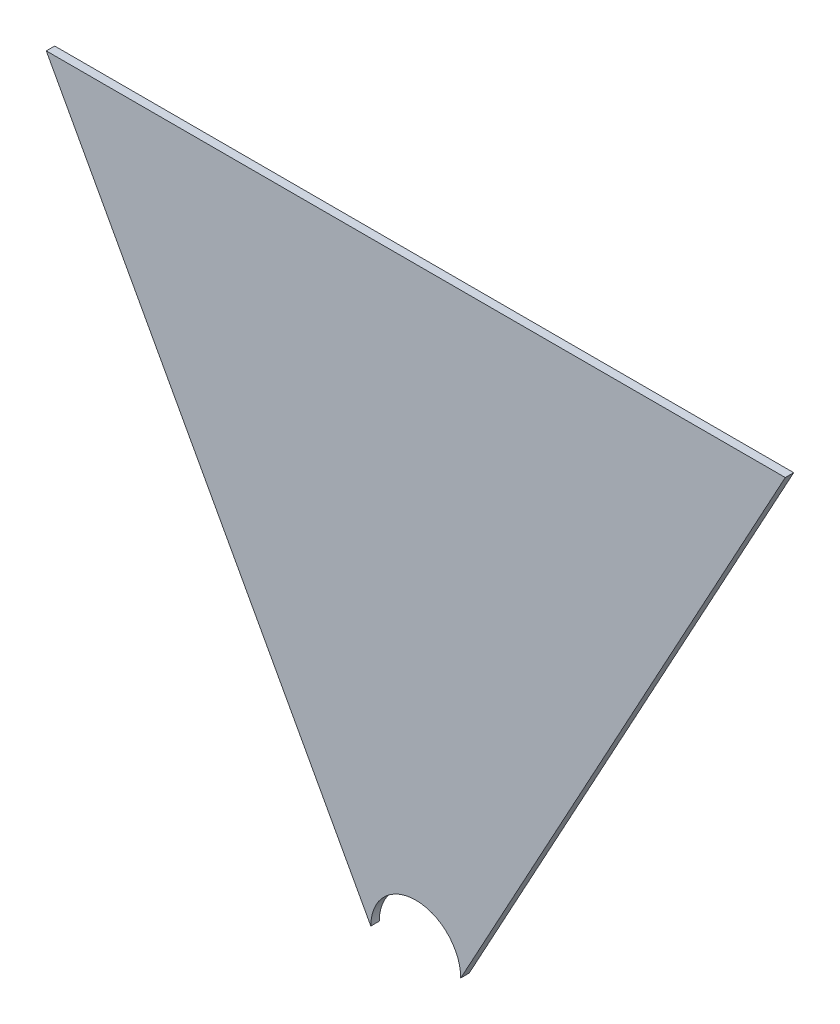
ISO-10303-21;
HEADER;
FILE_DESCRIPTION(('STEP AP214'),'2;1');
FILE_NAME('part.step','',(''),(''),'','','');
FILE_SCHEMA(('AUTOMOTIVE_DESIGN { 1 0 10303 214 1 1 1 1 }'));
ENDSEC;
DATA;
#1=APPLICATION_CONTEXT('core data for automotive mechanical design processes');
#2=APPLICATION_PROTOCOL_DEFINITION('international standard','automotive_design',2000,#1);
#3=PRODUCT_CONTEXT('',#1,'mechanical');
#4=PRODUCT('Part','Part','',(#3));
#5=PRODUCT_RELATED_PRODUCT_CATEGORY('part','',(#4));
#6=PRODUCT_DEFINITION_FORMATION('','',#4);
#7=PRODUCT_DEFINITION_CONTEXT('part definition',#1,'design');
#8=PRODUCT_DEFINITION('design','',#6,#7);
#9=PRODUCT_DEFINITION_SHAPE('','',#8);
#10=(LENGTH_UNIT() NAMED_UNIT(*) SI_UNIT(.MILLI.,.METRE.));
#11=(NAMED_UNIT(*) PLANE_ANGLE_UNIT() SI_UNIT($,.RADIAN.));
#12=(NAMED_UNIT(*) SI_UNIT($,.STERADIAN.) SOLID_ANGLE_UNIT());
#13=UNCERTAINTY_MEASURE_WITH_UNIT(LENGTH_MEASURE(1.E-05),#10,'distance_accuracy_value','');
#14=(GEOMETRIC_REPRESENTATION_CONTEXT(3) GLOBAL_UNCERTAINTY_ASSIGNED_CONTEXT((#13)) GLOBAL_UNIT_ASSIGNED_CONTEXT((#10,
#11,#12)) REPRESENTATION_CONTEXT('',''));
#15=CARTESIAN_POINT('',(0.,0.,0.));
#16=DIRECTION('',(0.,0.,1.));
#17=DIRECTION('',(1.,0.,0.));
#18=AXIS2_PLACEMENT_3D('',#15,#16,#17);
#19=CARTESIAN_POINT('',(-16.,0.,3.));
#20=DIRECTION('',(0.878132912292132,0.478416751744062,0.));
#21=DIRECTION('',(-0.478416751744062,0.878132912292132,0.));
#22=AXIS2_PLACEMENT_3D('',#19,#20,#21);
#23=PLANE('',#22);
#24=DIRECTION('',(0.478416751744062,-0.878132912292131,0.));
#25=VECTOR('',#24,1.);
#26=CARTESIAN_POINT('',(-16.,0.,0.));
#27=LINE('',#26,#25);
#28=CARTESIAN_POINT('',(-131.5,212.,0.));
#29=VERTEX_POINT('',#28);
#30=CARTESIAN_POINT('',(-16.,0.,0.));
#31=VERTEX_POINT('',#30);
#32=EDGE_CURVE('E96',#29,#31,#27,.T.);
#33=ORIENTED_EDGE('',*,*,#32,.T.);
#34=DIRECTION('',(0.,0.,-1.));
#35=VECTOR('',#34,1.);
#36=CARTESIAN_POINT('',(-16.,0.,3.));
#37=LINE('',#36,#35);
#38=CARTESIAN_POINT('',(-16.,0.,3.));
#39=VERTEX_POINT('',#38);
#40=EDGE_CURVE('E11',#39,#31,#37,.T.);
#41=ORIENTED_EDGE('',*,*,#40,.F.);
#42=DIRECTION('',(0.478416751744062,-0.878132912292131,0.));
#43=VECTOR('',#42,1.);
#44=CARTESIAN_POINT('',(-16.,0.,3.));
#45=LINE('',#44,#43);
#46=CARTESIAN_POINT('',(-131.5,212.,3.));
#47=VERTEX_POINT('',#46);
#48=EDGE_CURVE('E84',#47,#39,#45,.T.);
#49=ORIENTED_EDGE('',*,*,#48,.F.);
#50=DIRECTION('',(0.,0.,-1.));
#51=VECTOR('',#50,1.);
#52=CARTESIAN_POINT('',(-131.5,212.,3.));
#53=LINE('',#52,#51);
#54=EDGE_CURVE('E92',#47,#29,#53,.T.);
#55=ORIENTED_EDGE('',*,*,#54,.T.);
#56=EDGE_LOOP('',(#33,#41,#49,#55));
#57=FACE_BOUND('',#56,.T.);
#58=ADVANCED_FACE('F33',(#57),#23,.F.);
#59=CARTESIAN_POINT('',(0.,0.,3.));
#60=DIRECTION('',(0.,0.,-1.));
#61=DIRECTION('',(-1.,0.,0.));
#62=AXIS2_PLACEMENT_3D('',#59,#60,#61);
#63=CYLINDRICAL_SURFACE('',#62,16.);
#64=CARTESIAN_POINT('',(0.,0.,0.));
#65=DIRECTION('',(0.,0.,-1.));
#66=DIRECTION('',(1.,0.,0.));
#67=AXIS2_PLACEMENT_3D('',#64,#65,#66);
#68=CIRCLE('',#67,16.);
#69=CARTESIAN_POINT('',(16.,0.,0.));
#70=VERTEX_POINT('',#69);
#71=EDGE_CURVE('E88',#31,#70,#68,.T.);
#72=ORIENTED_EDGE('',*,*,#71,.T.);
#73=DIRECTION('',(0.,0.,-1.));
#74=VECTOR('',#73,1.);
#75=CARTESIAN_POINT('',(16.,0.,3.));
#76=LINE('',#75,#74);
#77=CARTESIAN_POINT('',(16.,0.,3.));
#78=VERTEX_POINT('',#77);
#79=EDGE_CURVE('E41',#78,#70,#76,.T.);
#80=ORIENTED_EDGE('',*,*,#79,.F.);
#81=CARTESIAN_POINT('',(0.,0.,3.));
#82=DIRECTION('',(0.,0.,-1.));
#83=DIRECTION('',(1.,0.,0.));
#84=AXIS2_PLACEMENT_3D('',#81,#82,#83);
#85=CIRCLE('',#84,16.);
#86=EDGE_CURVE('E79',#39,#78,#85,.T.);
#87=ORIENTED_EDGE('',*,*,#86,.F.);
#88=ORIENTED_EDGE('',*,*,#40,.T.);
#89=EDGE_LOOP('',(#72,#80,#87,#88));
#90=FACE_BOUND('',#89,.T.);
#91=ADVANCED_FACE('F87',(#90),#63,.F.);
#92=CARTESIAN_POINT('',(16.,0.,3.));
#93=DIRECTION('',(-0.878132912292132,0.478416751744062,0.));
#94=DIRECTION('',(-0.478416751744062,-0.878132912292132,0.));
#95=AXIS2_PLACEMENT_3D('',#92,#93,#94);
#96=PLANE('',#95);
#97=DIRECTION('',(0.478416751744062,0.878132912292132,0.));
#98=VECTOR('',#97,1.);
#99=CARTESIAN_POINT('',(16.,0.,0.));
#100=LINE('',#99,#98);
#101=CARTESIAN_POINT('',(131.5,212.,0.));
#102=VERTEX_POINT('',#101);
#103=EDGE_CURVE('E66',#70,#102,#100,.T.);
#104=ORIENTED_EDGE('',*,*,#103,.T.);
#105=DIRECTION('',(0.,0.,-1.));
#106=VECTOR('',#105,1.);
#107=CARTESIAN_POINT('',(131.5,212.,3.));
#108=LINE('',#107,#106);
#109=CARTESIAN_POINT('',(131.5,212.,3.));
#110=VERTEX_POINT('',#109);
#111=EDGE_CURVE('E89',#110,#102,#108,.T.);
#112=ORIENTED_EDGE('',*,*,#111,.F.);
#113=DIRECTION('',(0.478416751744062,0.878132912292132,0.));
#114=VECTOR('',#113,1.);
#115=CARTESIAN_POINT('',(16.,0.,3.));
#116=LINE('',#115,#114);
#117=EDGE_CURVE('E82',#78,#110,#116,.T.);
#118=ORIENTED_EDGE('',*,*,#117,.F.);
#119=ORIENTED_EDGE('',*,*,#79,.T.);
#120=EDGE_LOOP('',(#104,#112,#118,#119));
#121=FACE_BOUND('',#120,.T.);
#122=ADVANCED_FACE('F90',(#121),#96,.F.);
#123=CARTESIAN_POINT('',(-131.5,212.,3.));
#124=DIRECTION('',(0.,-1.,0.));
#125=DIRECTION('',(0.,0.,-1.));
#126=AXIS2_PLACEMENT_3D('',#123,#124,#125);
#127=PLANE('',#126);
#128=DIRECTION('',(-1.,0.,0.));
#129=VECTOR('',#128,1.);
#130=CARTESIAN_POINT('',(-131.5,212.,0.));
#131=LINE('',#130,#129);
#132=EDGE_CURVE('E72',#102,#29,#131,.T.);
#133=ORIENTED_EDGE('',*,*,#132,.T.);
#134=ORIENTED_EDGE('',*,*,#54,.F.);
#135=DIRECTION('',(-1.,0.,0.));
#136=VECTOR('',#135,1.);
#137=CARTESIAN_POINT('',(-131.5,212.,3.));
#138=LINE('',#137,#136);
#139=EDGE_CURVE('E49',#110,#47,#138,.T.);
#140=ORIENTED_EDGE('',*,*,#139,.F.);
#141=ORIENTED_EDGE('',*,*,#111,.T.);
#142=EDGE_LOOP('',(#133,#134,#140,#141));
#143=FACE_BOUND('',#142,.T.);
#144=ADVANCED_FACE('F103',(#143),#127,.F.);
#145=CARTESIAN_POINT('',(0.,0.,3.));
#146=DIRECTION('',(0.,0.,1.));
#147=DIRECTION('',(1.,0.,0.));
#148=AXIS2_PLACEMENT_3D('',#145,#146,#147);
#149=PLANE('',#148);
#150=ORIENTED_EDGE('',*,*,#48,.T.);
#151=ORIENTED_EDGE('',*,*,#86,.T.);
#152=ORIENTED_EDGE('',*,*,#117,.T.);
#153=ORIENTED_EDGE('',*,*,#139,.T.);
#154=EDGE_LOOP('',(#150,#151,#152,#153));
#155=FACE_BOUND('',#154,.T.);
#156=ADVANCED_FACE('F80',(#155),#149,.T.);
#157=CARTESIAN_POINT('',(0.,0.,0.));
#158=DIRECTION('',(0.,0.,1.));
#159=DIRECTION('',(1.,0.,0.));
#160=AXIS2_PLACEMENT_3D('',#157,#158,#159);
#161=PLANE('',#160);
#162=ORIENTED_EDGE('',*,*,#32,.F.);
#163=ORIENTED_EDGE('',*,*,#132,.F.);
#164=ORIENTED_EDGE('',*,*,#103,.F.);
#165=ORIENTED_EDGE('',*,*,#71,.F.);
#166=EDGE_LOOP('',(#162,#163,#164,#165));
#167=FACE_BOUND('',#166,.T.);
#168=ADVANCED_FACE('F106',(#167),#161,.F.);
#169=CLOSED_SHELL('',(#58,#91,#122,#144,#156,#168));
#170=MANIFOLD_SOLID_BREP('B2',#169);
#171=ADVANCED_BREP_SHAPE_REPRESENTATION('',(#18,#170),#14);
#172=SHAPE_DEFINITION_REPRESENTATION(#9,#171);
ENDSEC;
END-ISO-10303-21;
